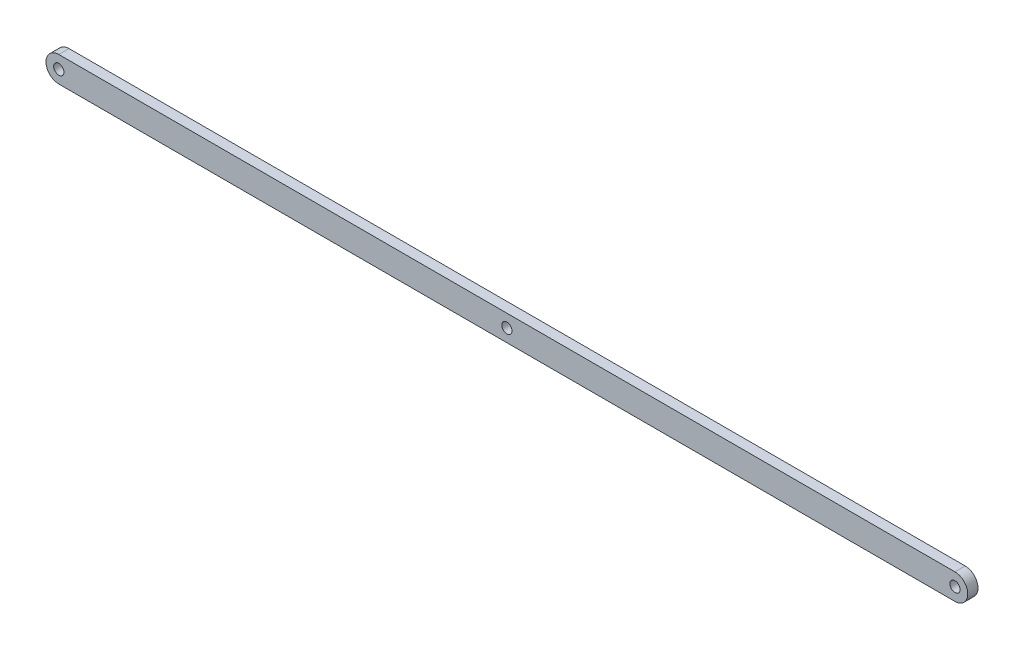
ISO-10303-21;
HEADER;
FILE_DESCRIPTION(('STEP AP214'),'2;1');
FILE_NAME('part.step','',(''),(''),'','','');
FILE_SCHEMA(('AUTOMOTIVE_DESIGN { 1 0 10303 214 1 1 1 1 }'));
ENDSEC;
DATA;
#1=APPLICATION_CONTEXT('core data for automotive mechanical design processes');
#2=APPLICATION_PROTOCOL_DEFINITION('international standard','automotive_design',2000,#1);
#3=PRODUCT_CONTEXT('',#1,'mechanical');
#4=PRODUCT('Part','Part','',(#3));
#5=PRODUCT_RELATED_PRODUCT_CATEGORY('part','',(#4));
#6=PRODUCT_DEFINITION_FORMATION('','',#4);
#7=PRODUCT_DEFINITION_CONTEXT('part definition',#1,'design');
#8=PRODUCT_DEFINITION('design','',#6,#7);
#9=PRODUCT_DEFINITION_SHAPE('','',#8);
#10=(LENGTH_UNIT() NAMED_UNIT(*) SI_UNIT(.MILLI.,.METRE.));
#11=(NAMED_UNIT(*) PLANE_ANGLE_UNIT() SI_UNIT($,.RADIAN.));
#12=(NAMED_UNIT(*) SI_UNIT($,.STERADIAN.) SOLID_ANGLE_UNIT());
#13=UNCERTAINTY_MEASURE_WITH_UNIT(LENGTH_MEASURE(1.E-05),#10,'distance_accuracy_value','');
#14=(GEOMETRIC_REPRESENTATION_CONTEXT(3) GLOBAL_UNCERTAINTY_ASSIGNED_CONTEXT((#13)) GLOBAL_UNIT_ASSIGNED_CONTEXT((#10,
#11,#12)) REPRESENTATION_CONTEXT('',''));
#15=CARTESIAN_POINT('',(0.,0.,0.));
#16=DIRECTION('',(0.,0.,1.));
#17=DIRECTION('',(1.,0.,0.));
#18=AXIS2_PLACEMENT_3D('',#15,#16,#17);
#19=CARTESIAN_POINT('',(-111.125,0.,2.54));
#20=DIRECTION('',(0.,0.,-1.));
#21=DIRECTION('',(-1.,0.,0.));
#22=AXIS2_PLACEMENT_3D('',#19,#20,#21);
#23=CYLINDRICAL_SURFACE('',#22,3.17500000000001);
#24=CARTESIAN_POINT('',(-111.125,0.,0.));
#25=DIRECTION('',(0.,0.,1.));
#26=DIRECTION('',(1.,0.,0.));
#27=AXIS2_PLACEMENT_3D('',#24,#25,#26);
#28=CIRCLE('',#27,3.17500000000001);
#29=CARTESIAN_POINT('',(-111.125,3.175,0.));
#30=VERTEX_POINT('',#29);
#31=CARTESIAN_POINT('',(-111.125,-3.175,0.));
#32=VERTEX_POINT('',#31);
#33=EDGE_CURVE('E123',#30,#32,#28,.T.);
#34=ORIENTED_EDGE('',*,*,#33,.T.);
#35=DIRECTION('',(0.,0.,-1.));
#36=VECTOR('',#35,1.);
#37=CARTESIAN_POINT('',(-111.125,-3.175,2.54));
#38=LINE('',#37,#36);
#39=CARTESIAN_POINT('',(-111.125,-3.175,2.54));
#40=VERTEX_POINT('',#39);
#41=EDGE_CURVE('E11',#40,#32,#38,.T.);
#42=ORIENTED_EDGE('',*,*,#41,.F.);
#43=CARTESIAN_POINT('',(-111.125,0.,2.54));
#44=DIRECTION('',(0.,0.,1.));
#45=DIRECTION('',(1.,0.,0.));
#46=AXIS2_PLACEMENT_3D('',#43,#44,#45);
#47=CIRCLE('',#46,3.17500000000001);
#48=CARTESIAN_POINT('',(-111.125,3.175,2.54));
#49=VERTEX_POINT('',#48);
#50=EDGE_CURVE('E93',#49,#40,#47,.T.);
#51=ORIENTED_EDGE('',*,*,#50,.F.);
#52=DIRECTION('',(0.,0.,-1.));
#53=VECTOR('',#52,1.);
#54=CARTESIAN_POINT('',(-111.125,3.175,2.54));
#55=LINE('',#54,#53);
#56=EDGE_CURVE('E59',#49,#30,#55,.T.);
#57=ORIENTED_EDGE('',*,*,#56,.T.);
#58=EDGE_LOOP('',(#34,#42,#51,#57));
#59=FACE_BOUND('',#58,.T.);
#60=ADVANCED_FACE('F41',(#59),#23,.T.);
#61=CARTESIAN_POINT('',(0.,-3.175,2.54));
#62=DIRECTION('',(0.,1.,0.));
#63=DIRECTION('',(0.,0.,1.));
#64=AXIS2_PLACEMENT_3D('',#61,#62,#63);
#65=PLANE('',#64);
#66=DIRECTION('',(1.,0.,0.));
#67=VECTOR('',#66,1.);
#68=CARTESIAN_POINT('',(0.,-3.175,0.));
#69=LINE('',#68,#67);
#70=CARTESIAN_POINT('',(111.125,-3.175,0.));
#71=VERTEX_POINT('',#70);
#72=EDGE_CURVE('E99',#32,#71,#69,.T.);
#73=ORIENTED_EDGE('',*,*,#72,.T.);
#74=DIRECTION('',(0.,0.,-1.));
#75=VECTOR('',#74,1.);
#76=CARTESIAN_POINT('',(111.125,-3.175,2.54));
#77=LINE('',#76,#75);
#78=CARTESIAN_POINT('',(111.125,-3.175,2.54));
#79=VERTEX_POINT('',#78);
#80=EDGE_CURVE('E51',#79,#71,#77,.T.);
#81=ORIENTED_EDGE('',*,*,#80,.F.);
#82=DIRECTION('',(1.,0.,0.));
#83=VECTOR('',#82,1.);
#84=CARTESIAN_POINT('',(0.,-3.175,2.54));
#85=LINE('',#84,#83);
#86=EDGE_CURVE('E85',#40,#79,#85,.T.);
#87=ORIENTED_EDGE('',*,*,#86,.F.);
#88=ORIENTED_EDGE('',*,*,#41,.T.);
#89=EDGE_LOOP('',(#73,#81,#87,#88));
#90=FACE_BOUND('',#89,.T.);
#91=ADVANCED_FACE('F98',(#90),#65,.F.);
#92=CARTESIAN_POINT('',(111.125,0.,2.54));
#93=DIRECTION('',(0.,0.,-1.));
#94=DIRECTION('',(-1.,0.,0.));
#95=AXIS2_PLACEMENT_3D('',#92,#93,#94);
#96=CYLINDRICAL_SURFACE('',#95,3.175);
#97=CARTESIAN_POINT('',(111.125,0.,0.));
#98=DIRECTION('',(0.,0.,1.));
#99=DIRECTION('',(1.,0.,0.));
#100=AXIS2_PLACEMENT_3D('',#97,#98,#99);
#101=CIRCLE('',#100,3.175);
#102=CARTESIAN_POINT('',(111.125,3.175,0.));
#103=VERTEX_POINT('',#102);
#104=EDGE_CURVE('E128',#71,#103,#101,.T.);
#105=ORIENTED_EDGE('',*,*,#104,.T.);
#106=DIRECTION('',(0.,0.,-1.));
#107=VECTOR('',#106,1.);
#108=CARTESIAN_POINT('',(111.125,3.175,2.54));
#109=LINE('',#108,#107);
#110=CARTESIAN_POINT('',(111.125,3.175,2.54));
#111=VERTEX_POINT('',#110);
#112=EDGE_CURVE('E74',#111,#103,#109,.T.);
#113=ORIENTED_EDGE('',*,*,#112,.F.);
#114=CARTESIAN_POINT('',(111.125,0.,2.54));
#115=DIRECTION('',(0.,0.,1.));
#116=DIRECTION('',(1.,0.,0.));
#117=AXIS2_PLACEMENT_3D('',#114,#115,#116);
#118=CIRCLE('',#117,3.175);
#119=EDGE_CURVE('E92',#79,#111,#118,.T.);
#120=ORIENTED_EDGE('',*,*,#119,.F.);
#121=ORIENTED_EDGE('',*,*,#80,.T.);
#122=EDGE_LOOP('',(#105,#113,#120,#121));
#123=FACE_BOUND('',#122,.T.);
#124=ADVANCED_FACE('F103',(#123),#96,.T.);
#125=CARTESIAN_POINT('',(0.,0.,2.54));
#126=DIRECTION('',(0.,0.,-1.));
#127=DIRECTION('',(-1.,0.,0.));
#128=AXIS2_PLACEMENT_3D('',#125,#126,#127);
#129=CYLINDRICAL_SURFACE('',#128,1.27);
#130=CARTESIAN_POINT('',(0.,0.,2.54));
#131=DIRECTION('',(0.,0.,1.));
#132=DIRECTION('',(1.,0.,0.));
#133=AXIS2_PLACEMENT_3D('',#130,#131,#132);
#134=CIRCLE('',#133,1.27);
#135=CARTESIAN_POINT('',(1.27,0.,2.54));
#136=VERTEX_POINT('',#135);
#137=EDGE_CURVE('E108',#136,#136,#134,.T.);
#138=ORIENTED_EDGE('',*,*,#137,.T.);
#139=EDGE_LOOP('',(#138));
#140=FACE_BOUND('',#139,.T.);
#141=CARTESIAN_POINT('',(0.,0.,0.));
#142=DIRECTION('',(0.,0.,1.));
#143=DIRECTION('',(1.,0.,0.));
#144=AXIS2_PLACEMENT_3D('',#141,#142,#143);
#145=CIRCLE('',#144,1.27);
#146=CARTESIAN_POINT('',(1.27,0.,0.));
#147=VERTEX_POINT('',#146);
#148=EDGE_CURVE('E135',#147,#147,#145,.T.);
#149=ORIENTED_EDGE('',*,*,#148,.F.);
#150=EDGE_LOOP('',(#149));
#151=FACE_BOUND('',#150,.T.);
#152=ADVANCED_FACE('F177',(#140,#151),#129,.F.);
#153=CARTESIAN_POINT('',(0.,3.175,2.54));
#154=DIRECTION('',(0.,1.,0.));
#155=DIRECTION('',(0.,0.,1.));
#156=AXIS2_PLACEMENT_3D('',#153,#154,#155);
#157=PLANE('',#156);
#158=DIRECTION('',(1.,0.,0.));
#159=VECTOR('',#158,1.);
#160=CARTESIAN_POINT('',(0.,3.175,0.));
#161=LINE('',#160,#159);
#162=EDGE_CURVE('E131',#30,#103,#161,.T.);
#163=ORIENTED_EDGE('',*,*,#162,.F.);
#164=ORIENTED_EDGE('',*,*,#56,.F.);
#165=DIRECTION('',(1.,0.,0.));
#166=VECTOR('',#165,1.);
#167=CARTESIAN_POINT('',(0.,3.175,2.54));
#168=LINE('',#167,#166);
#169=EDGE_CURVE('E105',#49,#111,#168,.T.);
#170=ORIENTED_EDGE('',*,*,#169,.T.);
#171=ORIENTED_EDGE('',*,*,#112,.T.);
#172=EDGE_LOOP('',(#163,#164,#170,#171));
#173=FACE_BOUND('',#172,.T.);
#174=ADVANCED_FACE('F178',(#173),#157,.T.);
#175=CARTESIAN_POINT('',(111.125,0.,2.54));
#176=DIRECTION('',(0.,0.,-1.));
#177=DIRECTION('',(-1.,0.,0.));
#178=AXIS2_PLACEMENT_3D('',#175,#176,#177);
#179=CYLINDRICAL_SURFACE('',#178,1.27);
#180=CARTESIAN_POINT('',(111.125,0.,2.54));
#181=DIRECTION('',(0.,0.,1.));
#182=DIRECTION('',(1.,0.,0.));
#183=AXIS2_PLACEMENT_3D('',#180,#181,#182);
#184=CIRCLE('',#183,1.27);
#185=CARTESIAN_POINT('',(112.395,0.,2.54));
#186=VERTEX_POINT('',#185);
#187=EDGE_CURVE('E143',#186,#186,#184,.T.);
#188=ORIENTED_EDGE('',*,*,#187,.T.);
#189=EDGE_LOOP('',(#188));
#190=FACE_BOUND('',#189,.T.);
#191=CARTESIAN_POINT('',(111.125,0.,0.));
#192=DIRECTION('',(0.,0.,1.));
#193=DIRECTION('',(1.,0.,0.));
#194=AXIS2_PLACEMENT_3D('',#191,#192,#193);
#195=CIRCLE('',#194,1.27);
#196=CARTESIAN_POINT('',(112.395,0.,0.));
#197=VERTEX_POINT('',#196);
#198=EDGE_CURVE('E119',#197,#197,#195,.T.);
#199=ORIENTED_EDGE('',*,*,#198,.F.);
#200=EDGE_LOOP('',(#199));
#201=FACE_BOUND('',#200,.T.);
#202=ADVANCED_FACE('F43',(#190,#201),#179,.F.);
#203=CARTESIAN_POINT('',(-111.125,0.,2.54));
#204=DIRECTION('',(0.,0.,-1.));
#205=DIRECTION('',(-1.,0.,0.));
#206=AXIS2_PLACEMENT_3D('',#203,#204,#205);
#207=CYLINDRICAL_SURFACE('',#206,1.27);
#208=CARTESIAN_POINT('',(-111.125,0.,2.54));
#209=DIRECTION('',(0.,0.,1.));
#210=DIRECTION('',(1.,0.,0.));
#211=AXIS2_PLACEMENT_3D('',#208,#209,#210);
#212=CIRCLE('',#211,1.27);
#213=CARTESIAN_POINT('',(-109.855,0.,2.54));
#214=VERTEX_POINT('',#213);
#215=EDGE_CURVE('E115',#214,#214,#212,.T.);
#216=ORIENTED_EDGE('',*,*,#215,.T.);
#217=EDGE_LOOP('',(#216));
#218=FACE_BOUND('',#217,.T.);
#219=CARTESIAN_POINT('',(-111.125,0.,0.));
#220=DIRECTION('',(0.,0.,1.));
#221=DIRECTION('',(1.,0.,0.));
#222=AXIS2_PLACEMENT_3D('',#219,#220,#221);
#223=CIRCLE('',#222,1.27);
#224=CARTESIAN_POINT('',(-109.855,0.,0.));
#225=VERTEX_POINT('',#224);
#226=EDGE_CURVE('E139',#225,#225,#223,.T.);
#227=ORIENTED_EDGE('',*,*,#226,.F.);
#228=EDGE_LOOP('',(#227));
#229=FACE_BOUND('',#228,.T.);
#230=ADVANCED_FACE('F159',(#218,#229),#207,.F.);
#231=CARTESIAN_POINT('',(0.,0.,2.54));
#232=DIRECTION('',(0.,0.,1.));
#233=DIRECTION('',(1.,0.,0.));
#234=AXIS2_PLACEMENT_3D('',#231,#232,#233);
#235=PLANE('',#234);
#236=ORIENTED_EDGE('',*,*,#187,.F.);
#237=EDGE_LOOP('',(#236));
#238=FACE_BOUND('',#237,.T.);
#239=ORIENTED_EDGE('',*,*,#50,.T.);
#240=ORIENTED_EDGE('',*,*,#86,.T.);
#241=ORIENTED_EDGE('',*,*,#119,.T.);
#242=ORIENTED_EDGE('',*,*,#169,.F.);
#243=EDGE_LOOP('',(#239,#240,#241,#242));
#244=FACE_BOUND('',#243,.T.);
#245=ORIENTED_EDGE('',*,*,#137,.F.);
#246=EDGE_LOOP('',(#245));
#247=FACE_BOUND('',#246,.T.);
#248=ORIENTED_EDGE('',*,*,#215,.F.);
#249=EDGE_LOOP('',(#248));
#250=FACE_BOUND('',#249,.T.);
#251=ADVANCED_FACE('F88',(#238,#244,#247,#250),#235,.T.);
#252=CARTESIAN_POINT('',(0.,0.,0.));
#253=DIRECTION('',(0.,0.,1.));
#254=DIRECTION('',(1.,0.,0.));
#255=AXIS2_PLACEMENT_3D('',#252,#253,#254);
#256=PLANE('',#255);
#257=ORIENTED_EDGE('',*,*,#198,.T.);
#258=EDGE_LOOP('',(#257));
#259=FACE_BOUND('',#258,.T.);
#260=ORIENTED_EDGE('',*,*,#33,.F.);
#261=ORIENTED_EDGE('',*,*,#162,.T.);
#262=ORIENTED_EDGE('',*,*,#104,.F.);
#263=ORIENTED_EDGE('',*,*,#72,.F.);
#264=EDGE_LOOP('',(#260,#261,#262,#263));
#265=FACE_BOUND('',#264,.T.);
#266=ORIENTED_EDGE('',*,*,#148,.T.);
#267=EDGE_LOOP('',(#266));
#268=FACE_BOUND('',#267,.T.);
#269=ORIENTED_EDGE('',*,*,#226,.T.);
#270=EDGE_LOOP('',(#269));
#271=FACE_BOUND('',#270,.T.);
#272=ADVANCED_FACE('F158',(#259,#265,#268,#271),#256,.F.);
#273=CLOSED_SHELL('',(#60,#91,#124,#152,#174,#202,#230,#251,#272));
#274=MANIFOLD_SOLID_BREP('B2',#273);
#275=ADVANCED_BREP_SHAPE_REPRESENTATION('',(#18,#274),#14);
#276=SHAPE_DEFINITION_REPRESENTATION(#9,#275);
ENDSEC;
END-ISO-10303-21;
